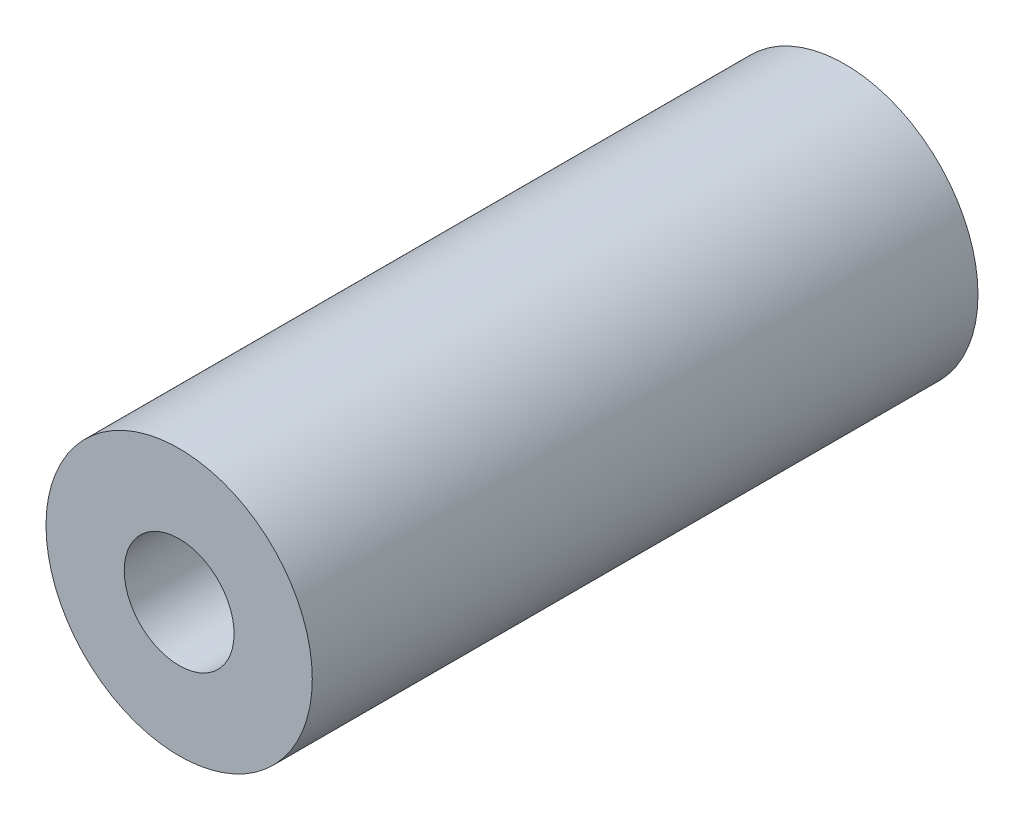
ISO-10303-21;
HEADER;
FILE_DESCRIPTION(('STEP AP214'),'2;1');
FILE_NAME('part.step','',(''),(''),'','','');
FILE_SCHEMA(('AUTOMOTIVE_DESIGN { 1 0 10303 214 1 1 1 1 }'));
ENDSEC;
DATA;
#1=APPLICATION_CONTEXT('core data for automotive mechanical design processes');
#2=APPLICATION_PROTOCOL_DEFINITION('international standard','automotive_design',2000,#1);
#3=PRODUCT_CONTEXT('',#1,'mechanical');
#4=PRODUCT('Part','Part','',(#3));
#5=PRODUCT_RELATED_PRODUCT_CATEGORY('part','',(#4));
#6=PRODUCT_DEFINITION_FORMATION('','',#4);
#7=PRODUCT_DEFINITION_CONTEXT('part definition',#1,'design');
#8=PRODUCT_DEFINITION('design','',#6,#7);
#9=PRODUCT_DEFINITION_SHAPE('','',#8);
#10=(LENGTH_UNIT() NAMED_UNIT(*) SI_UNIT(.MILLI.,.METRE.));
#11=(NAMED_UNIT(*) PLANE_ANGLE_UNIT() SI_UNIT($,.RADIAN.));
#12=(NAMED_UNIT(*) SI_UNIT($,.STERADIAN.) SOLID_ANGLE_UNIT());
#13=UNCERTAINTY_MEASURE_WITH_UNIT(LENGTH_MEASURE(1.E-05),#10,'distance_accuracy_value','');
#14=(GEOMETRIC_REPRESENTATION_CONTEXT(3) GLOBAL_UNCERTAINTY_ASSIGNED_CONTEXT((#13)) GLOBAL_UNIT_ASSIGNED_CONTEXT((#10,
#11,#12)) REPRESENTATION_CONTEXT('',''));
#15=CARTESIAN_POINT('',(0.,0.,0.));
#16=DIRECTION('',(0.,0.,1.));
#17=DIRECTION('',(1.,0.,0.));
#18=AXIS2_PLACEMENT_3D('',#15,#16,#17);
#19=CARTESIAN_POINT('',(0.,0.,20.));
#20=DIRECTION('',(0.,0.,-1.));
#21=DIRECTION('',(-1.,0.,0.));
#22=AXIS2_PLACEMENT_3D('',#19,#20,#21);
#23=CYLINDRICAL_SURFACE('',#22,4.);
#24=CARTESIAN_POINT('',(0.,0.,20.));
#25=DIRECTION('',(0.,0.,1.));
#26=DIRECTION('',(1.,0.,0.));
#27=AXIS2_PLACEMENT_3D('',#24,#25,#26);
#28=CIRCLE('',#27,4.);
#29=CARTESIAN_POINT('',(4.,0.,20.));
#30=VERTEX_POINT('',#29);
#31=EDGE_CURVE('E10',#30,#30,#28,.T.);
#32=ORIENTED_EDGE('',*,*,#31,.F.);
#33=EDGE_LOOP('',(#32));
#34=FACE_BOUND('',#33,.T.);
#35=CARTESIAN_POINT('',(0.,0.,0.));
#36=DIRECTION('',(0.,0.,1.));
#37=DIRECTION('',(1.,0.,0.));
#38=AXIS2_PLACEMENT_3D('',#35,#36,#37);
#39=CIRCLE('',#38,4.);
#40=CARTESIAN_POINT('',(4.,0.,0.));
#41=VERTEX_POINT('',#40);
#42=EDGE_CURVE('E34',#41,#41,#39,.T.);
#43=ORIENTED_EDGE('',*,*,#42,.T.);
#44=EDGE_LOOP('',(#43));
#45=FACE_BOUND('',#44,.T.);
#46=ADVANCED_FACE('F31',(#34,#45),#23,.T.);
#47=CARTESIAN_POINT('',(0.,0.,20.));
#48=DIRECTION('',(0.,0.,1.));
#49=DIRECTION('',(1.,0.,0.));
#50=AXIS2_PLACEMENT_3D('',#47,#48,#49);
#51=PLANE('',#50);
#52=CARTESIAN_POINT('',(0.,0.,20.));
#53=DIRECTION('',(0.,0.,1.));
#54=DIRECTION('',(1.,0.,0.));
#55=AXIS2_PLACEMENT_3D('',#52,#53,#54);
#56=CIRCLE('',#55,1.65);
#57=CARTESIAN_POINT('',(1.65,0.,20.));
#58=VERTEX_POINT('',#57);
#59=EDGE_CURVE('E41',#58,#58,#56,.T.);
#60=ORIENTED_EDGE('',*,*,#59,.F.);
#61=EDGE_LOOP('',(#60));
#62=FACE_BOUND('',#61,.T.);
#63=ORIENTED_EDGE('',*,*,#31,.T.);
#64=EDGE_LOOP('',(#63));
#65=FACE_BOUND('',#64,.T.);
#66=ADVANCED_FACE('F55',(#62,#65),#51,.T.);
#67=CARTESIAN_POINT('',(0.,0.,0.));
#68=DIRECTION('',(0.,0.,1.));
#69=DIRECTION('',(1.,0.,0.));
#70=AXIS2_PLACEMENT_3D('',#67,#68,#69);
#71=PLANE('',#70);
#72=CARTESIAN_POINT('',(0.,0.,0.));
#73=DIRECTION('',(0.,0.,-1.));
#74=DIRECTION('',(-1.,0.,0.));
#75=AXIS2_PLACEMENT_3D('',#72,#73,#74);
#76=CIRCLE('',#75,1.65);
#77=CARTESIAN_POINT('',(-1.65,0.,0.));
#78=VERTEX_POINT('',#77);
#79=EDGE_CURVE('E45',#78,#78,#76,.T.);
#80=ORIENTED_EDGE('',*,*,#79,.F.);
#81=EDGE_LOOP('',(#80));
#82=FACE_BOUND('',#81,.T.);
#83=ORIENTED_EDGE('',*,*,#42,.F.);
#84=EDGE_LOOP('',(#83));
#85=FACE_BOUND('',#84,.T.);
#86=ADVANCED_FACE('F52',(#82,#85),#71,.F.);
#87=CARTESIAN_POINT('',(0.,0.,0.));
#88=DIRECTION('',(0.,0.,-1.));
#89=DIRECTION('',(-1.,0.,0.));
#90=AXIS2_PLACEMENT_3D('',#87,#88,#89);
#91=CYLINDRICAL_SURFACE('',#90,1.65);
#92=ORIENTED_EDGE('',*,*,#79,.T.);
#93=EDGE_LOOP('',(#92));
#94=FACE_BOUND('',#93,.T.);
#95=ORIENTED_EDGE('',*,*,#59,.T.);
#96=EDGE_LOOP('',(#95));
#97=FACE_BOUND('',#96,.T.);
#98=ADVANCED_FACE('F49',(#94,#97),#91,.F.);
#99=CLOSED_SHELL('',(#46,#66,#86,#98));
#100=MANIFOLD_SOLID_BREP('B2',#99);
#101=ADVANCED_BREP_SHAPE_REPRESENTATION('',(#18,#100),#14);
#102=SHAPE_DEFINITION_REPRESENTATION(#9,#101);
ENDSEC;
END-ISO-10303-21;
